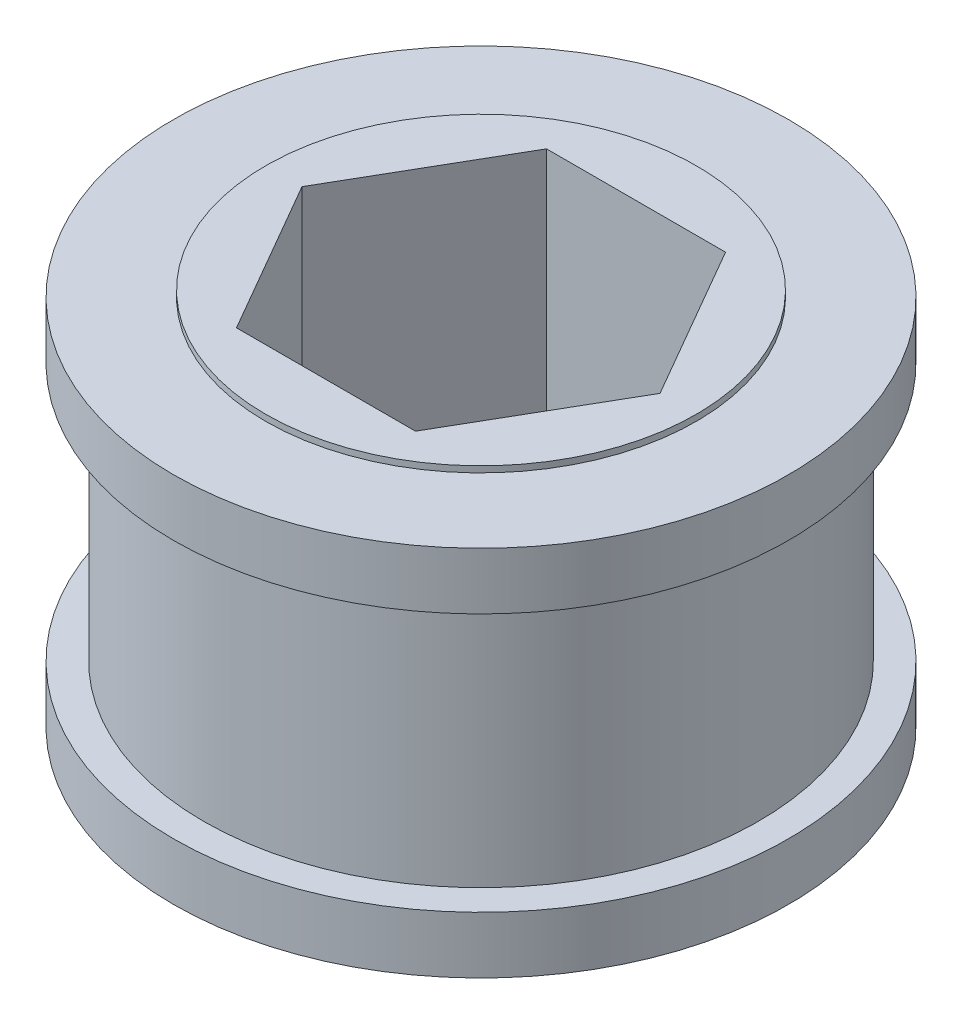
ISO-10303-21;
HEADER;
FILE_DESCRIPTION(('STEP AP214'),'2;1');
FILE_NAME('part.step','',(''),(''),'','','');
FILE_SCHEMA(('AUTOMOTIVE_DESIGN { 1 0 10303 214 1 1 1 1 }'));
ENDSEC;
DATA;
#1=APPLICATION_CONTEXT('core data for automotive mechanical design processes');
#2=APPLICATION_PROTOCOL_DEFINITION('international standard','automotive_design',2000,#1);
#3=PRODUCT_CONTEXT('',#1,'mechanical');
#4=PRODUCT('Part','Part','',(#3));
#5=PRODUCT_RELATED_PRODUCT_CATEGORY('part','',(#4));
#6=PRODUCT_DEFINITION_FORMATION('','',#4);
#7=PRODUCT_DEFINITION_CONTEXT('part definition',#1,'design');
#8=PRODUCT_DEFINITION('design','',#6,#7);
#9=PRODUCT_DEFINITION_SHAPE('','',#8);
#10=(LENGTH_UNIT() NAMED_UNIT(*) SI_UNIT(.MILLI.,.METRE.));
#11=(NAMED_UNIT(*) PLANE_ANGLE_UNIT() SI_UNIT($,.RADIAN.));
#12=(NAMED_UNIT(*) SI_UNIT($,.STERADIAN.) SOLID_ANGLE_UNIT());
#13=UNCERTAINTY_MEASURE_WITH_UNIT(LENGTH_MEASURE(1.E-05),#10,'distance_accuracy_value','');
#14=(GEOMETRIC_REPRESENTATION_CONTEXT(3) GLOBAL_UNCERTAINTY_ASSIGNED_CONTEXT((#13)) GLOBAL_UNIT_ASSIGNED_CONTEXT((#10,
#11,#12)) REPRESENTATION_CONTEXT('',''));
#15=CARTESIAN_POINT('',(0.,0.,0.));
#16=DIRECTION('',(0.,0.,1.));
#17=DIRECTION('',(1.,0.,0.));
#18=AXIS2_PLACEMENT_3D('',#15,#16,#17);
#19=CARTESIAN_POINT('',(0.,-3.21310000000001,-2.54));
#20=DIRECTION('',(0.,-1.,0.));
#21=DIRECTION('',(0.,0.,-1.));
#22=AXIS2_PLACEMENT_3D('',#19,#20,#21);
#23=PLANE('',#22);
#24=DIRECTION('',(1.,0.,0.));
#25=VECTOR('',#24,1.);
#26=CARTESIAN_POINT('',(0.,-3.21310000000001,-6.4008));
#27=LINE('',#26,#25);
#28=CARTESIAN_POINT('',(-3.69550360302896,-3.21310000000001,-6.4008));
#29=VERTEX_POINT('',#28);
#30=CARTESIAN_POINT('',(3.69550360302896,-3.21310000000001,-6.4008));
#31=VERTEX_POINT('',#30);
#32=EDGE_CURVE('E116',#29,#31,#27,.T.);
#33=ORIENTED_EDGE('',*,*,#32,.T.);
#34=DIRECTION('',(0.5,0.,0.866025403784439));
#35=VECTOR('',#34,1.);
#36=CARTESIAN_POINT('',(4.4434031417372,-3.21310000000001,-5.1054));
#37=LINE('',#36,#35);
#38=CARTESIAN_POINT('',(7.39100720605792,-3.21310000000001,0.));
#39=VERTEX_POINT('',#38);
#40=EDGE_CURVE('E91',#31,#39,#37,.T.);
#41=ORIENTED_EDGE('',*,*,#40,.T.);
#42=DIRECTION('',(-0.5,0.,0.866025403784439));
#43=VECTOR('',#42,1.);
#44=CARTESIAN_POINT('',(6.64310766734967,-3.21310000000001,1.29540000000001));
#45=LINE('',#44,#43);
#46=CARTESIAN_POINT('',(3.69550360302896,-3.21310000000001,6.4008));
#47=VERTEX_POINT('',#46);
#48=EDGE_CURVE('E137',#39,#47,#45,.T.);
#49=ORIENTED_EDGE('',*,*,#48,.T.);
#50=DIRECTION('',(-1.,0.,0.));
#51=VECTOR('',#50,1.);
#52=CARTESIAN_POINT('',(0.,-3.21310000000001,6.4008));
#53=LINE('',#52,#51);
#54=CARTESIAN_POINT('',(-3.69550360302896,-3.21310000000001,6.4008));
#55=VERTEX_POINT('',#54);
#56=EDGE_CURVE('E134',#47,#55,#53,.T.);
#57=ORIENTED_EDGE('',*,*,#56,.T.);
#58=DIRECTION('',(-0.5,0.,-0.866025403784439));
#59=VECTOR('',#58,1.);
#60=CARTESIAN_POINT('',(-6.64310766734967,-3.21310000000001,1.2954));
#61=LINE('',#60,#59);
#62=CARTESIAN_POINT('',(-7.39100720605791,-3.21310000000001,0.));
#63=VERTEX_POINT('',#62);
#64=EDGE_CURVE('E131',#55,#63,#61,.T.);
#65=ORIENTED_EDGE('',*,*,#64,.T.);
#66=DIRECTION('',(0.5,0.,-0.866025403784439));
#67=VECTOR('',#66,1.);
#68=CARTESIAN_POINT('',(-4.4434031417372,-3.21310000000001,-5.1054));
#69=LINE('',#68,#67);
#70=EDGE_CURVE('E128',#63,#29,#69,.T.);
#71=ORIENTED_EDGE('',*,*,#70,.T.);
#72=EDGE_LOOP('',(#33,#41,#49,#57,#65,#71));
#73=FACE_BOUND('',#72,.T.);
#74=CARTESIAN_POINT('',(0.,-3.2131,0.));
#75=DIRECTION('',(0.,1.,0.));
#76=DIRECTION('',(0.,0.,1.));
#77=AXIS2_PLACEMENT_3D('',#74,#75,#76);
#78=CIRCLE('',#77,8.89);
#79=CARTESIAN_POINT('',(0.,-3.2131,8.89));
#80=VERTEX_POINT('',#79);
#81=EDGE_CURVE('E11',#80,#80,#78,.T.);
#82=ORIENTED_EDGE('',*,*,#81,.T.);
#83=EDGE_LOOP('',(#82));
#84=FACE_BOUND('',#83,.T.);
#85=ADVANCED_FACE('F33',(#73,#84),#23,.F.);
#86=CARTESIAN_POINT('',(0.,55.,0.));
#87=DIRECTION('',(0.,1.,0.));
#88=DIRECTION('',(0.,0.,1.));
#89=AXIS2_PLACEMENT_3D('',#86,#87,#88);
#90=CYLINDRICAL_SURFACE('',#89,8.89);
#91=ORIENTED_EDGE('',*,*,#81,.F.);
#92=EDGE_LOOP('',(#91));
#93=FACE_BOUND('',#92,.T.);
#94=CARTESIAN_POINT('',(0.,-3.46710000000001,0.));
#95=DIRECTION('',(0.,1.,0.));
#96=DIRECTION('',(0.,0.,1.));
#97=AXIS2_PLACEMENT_3D('',#94,#95,#96);
#98=CIRCLE('',#97,8.89);
#99=CARTESIAN_POINT('',(0.,-3.46710000000001,8.89));
#100=VERTEX_POINT('',#99);
#101=EDGE_CURVE('E40',#100,#100,#98,.T.);
#102=ORIENTED_EDGE('',*,*,#101,.T.);
#103=EDGE_LOOP('',(#102));
#104=FACE_BOUND('',#103,.T.);
#105=ADVANCED_FACE('F167',(#93,#104),#90,.T.);
#106=CARTESIAN_POINT('',(0.,-3.46710000000001,-8.89));
#107=DIRECTION('',(0.,-1.,0.));
#108=DIRECTION('',(0.,0.,-1.));
#109=AXIS2_PLACEMENT_3D('',#106,#107,#108);
#110=PLANE('',#109);
#111=ORIENTED_EDGE('',*,*,#101,.F.);
#112=EDGE_LOOP('',(#111));
#113=FACE_BOUND('',#112,.T.);
#114=CARTESIAN_POINT('',(0.,-3.46710000000001,0.));
#115=DIRECTION('',(0.,1.,0.));
#116=DIRECTION('',(0.,0.,1.));
#117=AXIS2_PLACEMENT_3D('',#114,#115,#116);
#118=CIRCLE('',#117,12.7);
#119=CARTESIAN_POINT('',(0.,-3.46710000000001,12.7));
#120=VERTEX_POINT('',#119);
#121=EDGE_CURVE('E162',#120,#120,#118,.T.);
#122=ORIENTED_EDGE('',*,*,#121,.T.);
#123=EDGE_LOOP('',(#122));
#124=FACE_BOUND('',#123,.T.);
#125=ADVANCED_FACE('F169',(#113,#124),#110,.F.);
#126=CARTESIAN_POINT('',(0.,55.,0.));
#127=DIRECTION('',(0.,1.,0.));
#128=DIRECTION('',(0.,0.,1.));
#129=AXIS2_PLACEMENT_3D('',#126,#127,#128);
#130=CYLINDRICAL_SURFACE('',#129,12.7);
#131=ORIENTED_EDGE('',*,*,#121,.F.);
#132=EDGE_LOOP('',(#131));
#133=FACE_BOUND('',#132,.T.);
#134=CARTESIAN_POINT('',(0.,-5.8166,0.));
#135=DIRECTION('',(0.,1.,0.));
#136=DIRECTION('',(0.,0.,1.));
#137=AXIS2_PLACEMENT_3D('',#134,#135,#136);
#138=CIRCLE('',#137,12.7);
#139=CARTESIAN_POINT('',(0.,-5.8166,12.7));
#140=VERTEX_POINT('',#139);
#141=EDGE_CURVE('E159',#140,#140,#138,.T.);
#142=ORIENTED_EDGE('',*,*,#141,.T.);
#143=EDGE_LOOP('',(#142));
#144=FACE_BOUND('',#143,.T.);
#145=ADVANCED_FACE('F172',(#133,#144),#130,.T.);
#146=CARTESIAN_POINT('',(0.,-5.81660000000001,-11.4554));
#147=DIRECTION('',(0.,1.,0.));
#148=DIRECTION('',(0.,0.,1.));
#149=AXIS2_PLACEMENT_3D('',#146,#147,#148);
#150=PLANE('',#149);
#151=ORIENTED_EDGE('',*,*,#141,.F.);
#152=EDGE_LOOP('',(#151));
#153=FACE_BOUND('',#152,.T.);
#154=CARTESIAN_POINT('',(0.,-5.8166,0.));
#155=DIRECTION('',(0.,1.,0.));
#156=DIRECTION('',(0.,0.,1.));
#157=AXIS2_PLACEMENT_3D('',#154,#155,#156);
#158=CIRCLE('',#157,11.4554);
#159=CARTESIAN_POINT('',(0.,-5.8166,11.4554));
#160=VERTEX_POINT('',#159);
#161=EDGE_CURVE('E156',#160,#160,#158,.T.);
#162=ORIENTED_EDGE('',*,*,#161,.T.);
#163=EDGE_LOOP('',(#162));
#164=FACE_BOUND('',#163,.T.);
#165=ADVANCED_FACE('F178',(#153,#164),#150,.F.);
#166=CARTESIAN_POINT('',(0.,55.,0.));
#167=DIRECTION('',(0.,1.,0.));
#168=DIRECTION('',(0.,0.,1.));
#169=AXIS2_PLACEMENT_3D('',#166,#167,#168);
#170=CYLINDRICAL_SURFACE('',#169,11.4554);
#171=ORIENTED_EDGE('',*,*,#161,.F.);
#172=EDGE_LOOP('',(#171));
#173=FACE_BOUND('',#172,.T.);
#174=CARTESIAN_POINT('',(0.,-16.4846,0.));
#175=DIRECTION('',(0.,1.,0.));
#176=DIRECTION('',(0.,0.,1.));
#177=AXIS2_PLACEMENT_3D('',#174,#175,#176);
#178=CIRCLE('',#177,11.4554);
#179=CARTESIAN_POINT('',(0.,-16.4846,11.4554));
#180=VERTEX_POINT('',#179);
#181=EDGE_CURVE('E153',#180,#180,#178,.T.);
#182=ORIENTED_EDGE('',*,*,#181,.T.);
#183=EDGE_LOOP('',(#182));
#184=FACE_BOUND('',#183,.T.);
#185=ADVANCED_FACE('F184',(#173,#184),#170,.T.);
#186=CARTESIAN_POINT('',(0.,-16.4846,-11.4554));
#187=DIRECTION('',(0.,-1.,0.));
#188=DIRECTION('',(0.,0.,-1.));
#189=AXIS2_PLACEMENT_3D('',#186,#187,#188);
#190=PLANE('',#189);
#191=ORIENTED_EDGE('',*,*,#181,.F.);
#192=EDGE_LOOP('',(#191));
#193=FACE_BOUND('',#192,.T.);
#194=CARTESIAN_POINT('',(0.,-16.4846,0.));
#195=DIRECTION('',(0.,1.,0.));
#196=DIRECTION('',(0.,0.,1.));
#197=AXIS2_PLACEMENT_3D('',#194,#195,#196);
#198=CIRCLE('',#197,12.7);
#199=CARTESIAN_POINT('',(0.,-16.4846,12.7));
#200=VERTEX_POINT('',#199);
#201=EDGE_CURVE('E150',#200,#200,#198,.T.);
#202=ORIENTED_EDGE('',*,*,#201,.T.);
#203=EDGE_LOOP('',(#202));
#204=FACE_BOUND('',#203,.T.);
#205=ADVANCED_FACE('F190',(#193,#204),#190,.F.);
#206=CARTESIAN_POINT('',(0.,55.,0.));
#207=DIRECTION('',(0.,1.,0.));
#208=DIRECTION('',(0.,0.,1.));
#209=AXIS2_PLACEMENT_3D('',#206,#207,#208);
#210=CYLINDRICAL_SURFACE('',#209,12.7);
#211=ORIENTED_EDGE('',*,*,#201,.F.);
#212=EDGE_LOOP('',(#211));
#213=FACE_BOUND('',#212,.T.);
#214=CARTESIAN_POINT('',(0.,-18.8341,0.));
#215=DIRECTION('',(0.,1.,0.));
#216=DIRECTION('',(0.,0.,1.));
#217=AXIS2_PLACEMENT_3D('',#214,#215,#216);
#218=CIRCLE('',#217,12.7);
#219=CARTESIAN_POINT('',(0.,-18.8341,12.7));
#220=VERTEX_POINT('',#219);
#221=EDGE_CURVE('E147',#220,#220,#218,.T.);
#222=ORIENTED_EDGE('',*,*,#221,.T.);
#223=EDGE_LOOP('',(#222));
#224=FACE_BOUND('',#223,.T.);
#225=ADVANCED_FACE('F196',(#213,#224),#210,.T.);
#226=CARTESIAN_POINT('',(0.,-18.8341,-12.7));
#227=DIRECTION('',(0.,1.,0.));
#228=DIRECTION('',(0.,0.,1.));
#229=AXIS2_PLACEMENT_3D('',#226,#227,#228);
#230=PLANE('',#229);
#231=ORIENTED_EDGE('',*,*,#221,.F.);
#232=EDGE_LOOP('',(#231));
#233=FACE_BOUND('',#232,.T.);
#234=CARTESIAN_POINT('',(0.,-18.8341,0.));
#235=DIRECTION('',(0.,1.,0.));
#236=DIRECTION('',(0.,0.,1.));
#237=AXIS2_PLACEMENT_3D('',#234,#235,#236);
#238=CIRCLE('',#237,8.89);
#239=CARTESIAN_POINT('',(0.,-18.8341,8.89));
#240=VERTEX_POINT('',#239);
#241=EDGE_CURVE('E144',#240,#240,#238,.T.);
#242=ORIENTED_EDGE('',*,*,#241,.T.);
#243=EDGE_LOOP('',(#242));
#244=FACE_BOUND('',#243,.T.);
#245=ADVANCED_FACE('F202',(#233,#244),#230,.F.);
#246=CARTESIAN_POINT('',(0.,55.,0.));
#247=DIRECTION('',(0.,1.,0.));
#248=DIRECTION('',(0.,0.,1.));
#249=AXIS2_PLACEMENT_3D('',#246,#247,#248);
#250=CYLINDRICAL_SURFACE('',#249,8.89);
#251=ORIENTED_EDGE('',*,*,#241,.F.);
#252=EDGE_LOOP('',(#251));
#253=FACE_BOUND('',#252,.T.);
#254=CARTESIAN_POINT('',(0.,-19.0881,0.));
#255=DIRECTION('',(0.,1.,0.));
#256=DIRECTION('',(0.,0.,1.));
#257=AXIS2_PLACEMENT_3D('',#254,#255,#256);
#258=CIRCLE('',#257,8.89);
#259=CARTESIAN_POINT('',(0.,-19.0881,8.89));
#260=VERTEX_POINT('',#259);
#261=EDGE_CURVE('E141',#260,#260,#258,.T.);
#262=ORIENTED_EDGE('',*,*,#261,.T.);
#263=EDGE_LOOP('',(#262));
#264=FACE_BOUND('',#263,.T.);
#265=ADVANCED_FACE('F208',(#253,#264),#250,.T.);
#266=CARTESIAN_POINT('',(0.,-19.0881,-8.89));
#267=DIRECTION('',(0.,1.,0.));
#268=DIRECTION('',(0.,0.,1.));
#269=AXIS2_PLACEMENT_3D('',#266,#267,#268);
#270=PLANE('',#269);
#271=DIRECTION('',(0.5,0.,-0.866025403784438));
#272=VECTOR('',#271,1.);
#273=CARTESIAN_POINT('',(3.69550360302896,-19.0881,6.4008));
#274=LINE('',#273,#272);
#275=CARTESIAN_POINT('',(3.69550360302896,-19.0881,6.4008));
#276=VERTEX_POINT('',#275);
#277=CARTESIAN_POINT('',(7.39100720605792,-19.0881,0.));
#278=VERTEX_POINT('',#277);
#279=EDGE_CURVE('E94',#276,#278,#274,.T.);
#280=ORIENTED_EDGE('',*,*,#279,.T.);
#281=DIRECTION('',(-0.5,0.,-0.866025403784438));
#282=VECTOR('',#281,1.);
#283=CARTESIAN_POINT('',(7.39100720605792,-19.0881,0.));
#284=LINE('',#283,#282);
#285=CARTESIAN_POINT('',(3.69550360302896,-19.0881,-6.4008));
#286=VERTEX_POINT('',#285);
#287=EDGE_CURVE('E88',#278,#286,#284,.T.);
#288=ORIENTED_EDGE('',*,*,#287,.T.);
#289=DIRECTION('',(-1.,0.,0.));
#290=VECTOR('',#289,1.);
#291=CARTESIAN_POINT('',(3.69550360302896,-19.0881,-6.4008));
#292=LINE('',#291,#290);
#293=CARTESIAN_POINT('',(-3.69550360302896,-19.0881,-6.4008));
#294=VERTEX_POINT('',#293);
#295=EDGE_CURVE('E97',#286,#294,#292,.T.);
#296=ORIENTED_EDGE('',*,*,#295,.T.);
#297=DIRECTION('',(-0.5,0.,0.866025403784439));
#298=VECTOR('',#297,1.);
#299=CARTESIAN_POINT('',(-3.69550360302896,-19.0881,-6.4008));
#300=LINE('',#299,#298);
#301=CARTESIAN_POINT('',(-7.39100720605791,-19.0881,0.));
#302=VERTEX_POINT('',#301);
#303=EDGE_CURVE('E55',#294,#302,#300,.T.);
#304=ORIENTED_EDGE('',*,*,#303,.T.);
#305=DIRECTION('',(0.5,0.,0.866025403784439));
#306=VECTOR('',#305,1.);
#307=CARTESIAN_POINT('',(-7.39100720605791,-19.0881,0.));
#308=LINE('',#307,#306);
#309=CARTESIAN_POINT('',(-3.69550360302896,-19.0881,6.4008));
#310=VERTEX_POINT('',#309);
#311=EDGE_CURVE('E108',#302,#310,#308,.T.);
#312=ORIENTED_EDGE('',*,*,#311,.T.);
#313=DIRECTION('',(1.,0.,0.));
#314=VECTOR('',#313,1.);
#315=CARTESIAN_POINT('',(-3.69550360302896,-19.0881,6.4008));
#316=LINE('',#315,#314);
#317=EDGE_CURVE('E111',#310,#276,#316,.T.);
#318=ORIENTED_EDGE('',*,*,#317,.T.);
#319=EDGE_LOOP('',(#280,#288,#296,#304,#312,#318));
#320=FACE_BOUND('',#319,.T.);
#321=ORIENTED_EDGE('',*,*,#261,.F.);
#322=EDGE_LOOP('',(#321));
#323=FACE_BOUND('',#322,.T.);
#324=ADVANCED_FACE('F101',(#320,#323),#270,.F.);
#325=CARTESIAN_POINT('',(7.39100720605792,-19.0881,0.));
#326=DIRECTION('',(0.866025403784438,0.,-0.5));
#327=DIRECTION('',(-0.5,0.,-0.866025403784439));
#328=AXIS2_PLACEMENT_3D('',#325,#326,#327);
#329=PLANE('',#328);
#330=DIRECTION('',(0.,1.,0.));
#331=VECTOR('',#330,1.);
#332=CARTESIAN_POINT('',(3.69550360302896,-19.0881,-6.4008));
#333=LINE('',#332,#331);
#334=EDGE_CURVE('E47',#286,#31,#333,.T.);
#335=ORIENTED_EDGE('',*,*,#334,.F.);
#336=ORIENTED_EDGE('',*,*,#287,.F.);
#337=DIRECTION('',(0.,1.,0.));
#338=VECTOR('',#337,1.);
#339=CARTESIAN_POINT('',(7.39100720605792,-19.0881,0.));
#340=LINE('',#339,#338);
#341=EDGE_CURVE('E114',#278,#39,#340,.T.);
#342=ORIENTED_EDGE('',*,*,#341,.T.);
#343=ORIENTED_EDGE('',*,*,#40,.F.);
#344=EDGE_LOOP('',(#335,#336,#342,#343));
#345=FACE_BOUND('',#344,.T.);
#346=ADVANCED_FACE('F85',(#345),#329,.F.);
#347=CARTESIAN_POINT('',(3.69550360302896,-19.0881,6.4008));
#348=DIRECTION('',(0.866025403784438,0.,0.5));
#349=DIRECTION('',(0.5,0.,-0.866025403784439));
#350=AXIS2_PLACEMENT_3D('',#347,#348,#349);
#351=PLANE('',#350);
#352=ORIENTED_EDGE('',*,*,#341,.F.);
#353=ORIENTED_EDGE('',*,*,#279,.F.);
#354=DIRECTION('',(0.,1.,0.));
#355=VECTOR('',#354,1.);
#356=CARTESIAN_POINT('',(3.69550360302896,-19.0881,6.4008));
#357=LINE('',#356,#355);
#358=EDGE_CURVE('E117',#276,#47,#357,.T.);
#359=ORIENTED_EDGE('',*,*,#358,.T.);
#360=ORIENTED_EDGE('',*,*,#48,.F.);
#361=EDGE_LOOP('',(#352,#353,#359,#360));
#362=FACE_BOUND('',#361,.T.);
#363=ADVANCED_FACE('F221',(#362),#351,.F.);
#364=CARTESIAN_POINT('',(-3.69550360302896,-19.0881,6.4008));
#365=DIRECTION('',(0.,0.,1.));
#366=DIRECTION('',(1.,0.,0.));
#367=AXIS2_PLACEMENT_3D('',#364,#365,#366);
#368=PLANE('',#367);
#369=ORIENTED_EDGE('',*,*,#358,.F.);
#370=ORIENTED_EDGE('',*,*,#317,.F.);
#371=DIRECTION('',(0.,1.,0.));
#372=VECTOR('',#371,1.);
#373=CARTESIAN_POINT('',(-3.69550360302896,-19.0881,6.4008));
#374=LINE('',#373,#372);
#375=EDGE_CURVE('E120',#310,#55,#374,.T.);
#376=ORIENTED_EDGE('',*,*,#375,.T.);
#377=ORIENTED_EDGE('',*,*,#56,.F.);
#378=EDGE_LOOP('',(#369,#370,#376,#377));
#379=FACE_BOUND('',#378,.T.);
#380=ADVANCED_FACE('F236',(#379),#368,.F.);
#381=CARTESIAN_POINT('',(-7.39100720605791,-19.0881,0.));
#382=DIRECTION('',(-0.866025403784439,0.,0.5));
#383=DIRECTION('',(0.5,0.,0.866025403784439));
#384=AXIS2_PLACEMENT_3D('',#381,#382,#383);
#385=PLANE('',#384);
#386=ORIENTED_EDGE('',*,*,#375,.F.);
#387=ORIENTED_EDGE('',*,*,#311,.F.);
#388=DIRECTION('',(0.,1.,0.));
#389=VECTOR('',#388,1.);
#390=CARTESIAN_POINT('',(-7.39100720605791,-19.0881,0.));
#391=LINE('',#390,#389);
#392=EDGE_CURVE('E123',#302,#63,#391,.T.);
#393=ORIENTED_EDGE('',*,*,#392,.T.);
#394=ORIENTED_EDGE('',*,*,#64,.F.);
#395=EDGE_LOOP('',(#386,#387,#393,#394));
#396=FACE_BOUND('',#395,.T.);
#397=ADVANCED_FACE('F234',(#396),#385,.F.);
#398=CARTESIAN_POINT('',(-3.69550360302896,-19.0881,-6.4008));
#399=DIRECTION('',(-0.866025403784439,0.,-0.5));
#400=DIRECTION('',(-0.5,0.,0.866025403784439));
#401=AXIS2_PLACEMENT_3D('',#398,#399,#400);
#402=PLANE('',#401);
#403=ORIENTED_EDGE('',*,*,#392,.F.);
#404=ORIENTED_EDGE('',*,*,#303,.F.);
#405=DIRECTION('',(0.,1.,0.));
#406=VECTOR('',#405,1.);
#407=CARTESIAN_POINT('',(-3.69550360302896,-19.0881,-6.4008));
#408=LINE('',#407,#406);
#409=EDGE_CURVE('E93',#294,#29,#408,.T.);
#410=ORIENTED_EDGE('',*,*,#409,.T.);
#411=ORIENTED_EDGE('',*,*,#70,.F.);
#412=EDGE_LOOP('',(#403,#404,#410,#411));
#413=FACE_BOUND('',#412,.T.);
#414=ADVANCED_FACE('F231',(#413),#402,.F.);
#415=CARTESIAN_POINT('',(3.69550360302896,-19.0881,-6.4008));
#416=DIRECTION('',(0.,0.,-1.));
#417=DIRECTION('',(-1.,0.,0.));
#418=AXIS2_PLACEMENT_3D('',#415,#416,#417);
#419=PLANE('',#418);
#420=ORIENTED_EDGE('',*,*,#409,.F.);
#421=ORIENTED_EDGE('',*,*,#295,.F.);
#422=ORIENTED_EDGE('',*,*,#334,.T.);
#423=ORIENTED_EDGE('',*,*,#32,.F.);
#424=EDGE_LOOP('',(#420,#421,#422,#423));
#425=FACE_BOUND('',#424,.T.);
#426=ADVANCED_FACE('F98',(#425),#419,.F.);
#427=CLOSED_SHELL('',(#85,#105,#125,#145,#165,#185,#205,#225,#245,#265,#324,#346,#363,#380,#397,
#414,#426));
#428=MANIFOLD_SOLID_BREP('B2',#427);
#429=ADVANCED_BREP_SHAPE_REPRESENTATION('',(#18,#428),#14);
#430=SHAPE_DEFINITION_REPRESENTATION(#9,#429);
ENDSEC;
END-ISO-10303-21;
